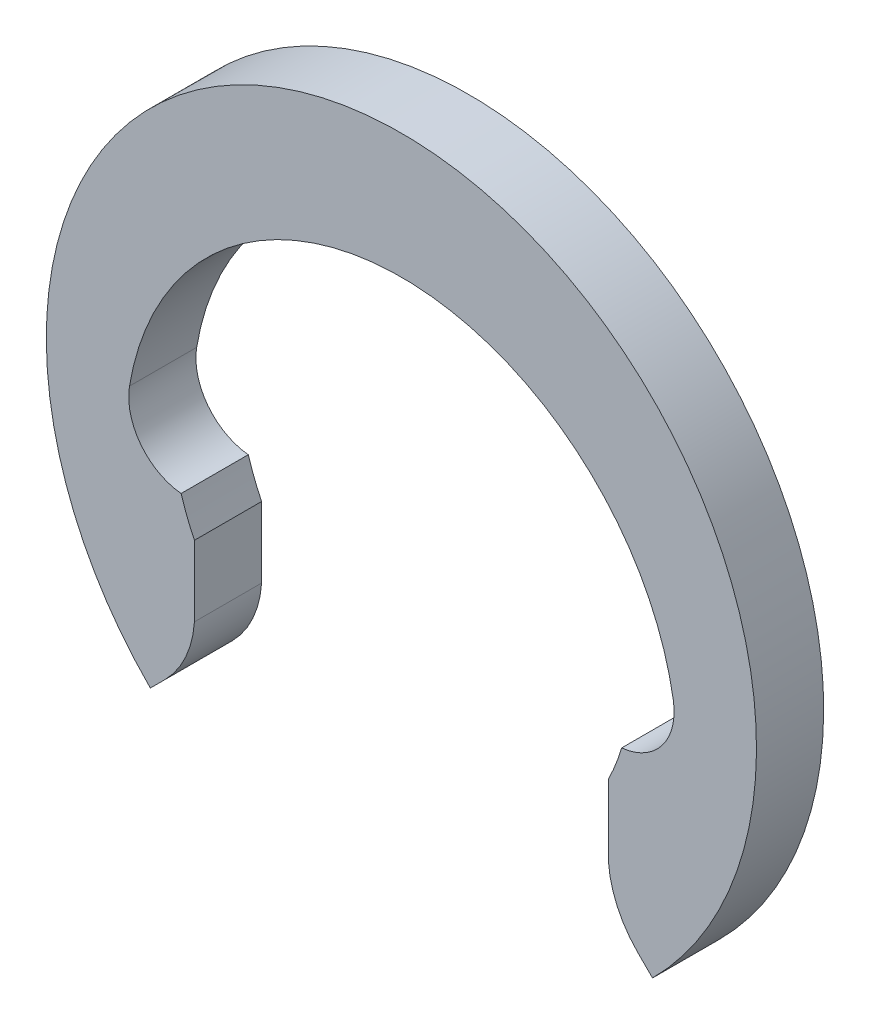
ISO-10303-21;
HEADER;
FILE_DESCRIPTION(('STEP AP214'),'2;1');
FILE_NAME('part.step','',(''),(''),'','','');
FILE_SCHEMA(('AUTOMOTIVE_DESIGN { 1 0 10303 214 1 1 1 1 }'));
ENDSEC;
DATA;
#1=APPLICATION_CONTEXT('core data for automotive mechanical design processes');
#2=APPLICATION_PROTOCOL_DEFINITION('international standard','automotive_design',2000,#1);
#3=PRODUCT_CONTEXT('',#1,'mechanical');
#4=PRODUCT('Part','Part','',(#3));
#5=PRODUCT_RELATED_PRODUCT_CATEGORY('part','',(#4));
#6=PRODUCT_DEFINITION_FORMATION('','',#4);
#7=PRODUCT_DEFINITION_CONTEXT('part definition',#1,'design');
#8=PRODUCT_DEFINITION('design','',#6,#7);
#9=PRODUCT_DEFINITION_SHAPE('','',#8);
#10=(LENGTH_UNIT() NAMED_UNIT(*) SI_UNIT(.MILLI.,.METRE.));
#11=(NAMED_UNIT(*) PLANE_ANGLE_UNIT() SI_UNIT($,.RADIAN.));
#12=(NAMED_UNIT(*) SI_UNIT($,.STERADIAN.) SOLID_ANGLE_UNIT());
#13=UNCERTAINTY_MEASURE_WITH_UNIT(LENGTH_MEASURE(1.E-05),#10,'distance_accuracy_value','');
#14=(GEOMETRIC_REPRESENTATION_CONTEXT(3) GLOBAL_UNCERTAINTY_ASSIGNED_CONTEXT((#13)) GLOBAL_UNIT_ASSIGNED_CONTEXT((#10,
#11,#12)) REPRESENTATION_CONTEXT('',''));
#15=CARTESIAN_POINT('',(0.,0.,0.));
#16=DIRECTION('',(0.,0.,1.));
#17=DIRECTION('',(1.,0.,0.));
#18=AXIS2_PLACEMENT_3D('',#15,#16,#17);
#19=CARTESIAN_POINT('',(-2.23805935440949,-0.0992609633156405,0.7));
#20=DIRECTION('',(0.,0.,-1.));
#21=DIRECTION('',(-1.,0.,0.));
#22=AXIS2_PLACEMENT_3D('',#19,#20,#21);
#23=CYLINDRICAL_SURFACE('',#22,0.603493039580553);
#24=CARTESIAN_POINT('',(-2.23805935440949,-0.0992609633156405,0.));
#25=DIRECTION('',(0.,0.,-1.));
#26=DIRECTION('',(1.,0.,0.));
#27=AXIS2_PLACEMENT_3D('',#24,#25,#26);
#28=CIRCLE('',#27,0.603493039580553);
#29=CARTESIAN_POINT('',(-2.2956480566498,-0.699999999999999,0.));
#30=VERTEX_POINT('',#29);
#31=CARTESIAN_POINT('',(-2.83333333333333,0.,0.));
#32=VERTEX_POINT('',#31);
#33=EDGE_CURVE('E152',#30,#32,#28,.T.);
#34=ORIENTED_EDGE('',*,*,#33,.T.);
#35=DIRECTION('',(0.,0.,-1.));
#36=VECTOR('',#35,1.);
#37=CARTESIAN_POINT('',(-2.83333333333333,0.,0.7));
#38=LINE('',#37,#36);
#39=CARTESIAN_POINT('',(-2.83333333333333,0.,0.7));
#40=VERTEX_POINT('',#39);
#41=EDGE_CURVE('E11',#40,#32,#38,.T.);
#42=ORIENTED_EDGE('',*,*,#41,.F.);
#43=CARTESIAN_POINT('',(-2.23805935440949,-0.0992609633156405,0.7));
#44=DIRECTION('',(0.,0.,-1.));
#45=DIRECTION('',(1.,0.,0.));
#46=AXIS2_PLACEMENT_3D('',#43,#44,#45);
#47=CIRCLE('',#46,0.603493039580553);
#48=CARTESIAN_POINT('',(-2.2956480566498,-0.699999999999999,0.7));
#49=VERTEX_POINT('',#48);
#50=EDGE_CURVE('E175',#49,#40,#47,.T.);
#51=ORIENTED_EDGE('',*,*,#50,.F.);
#52=DIRECTION('',(0.,0.,-1.));
#53=VECTOR('',#52,1.);
#54=CARTESIAN_POINT('',(-2.2956480566498,-0.699999999999999,0.7));
#55=LINE('',#54,#53);
#56=EDGE_CURVE('E148',#49,#30,#55,.T.);
#57=ORIENTED_EDGE('',*,*,#56,.T.);
#58=EDGE_LOOP('',(#34,#42,#51,#57));
#59=FACE_BOUND('',#58,.T.);
#60=ADVANCED_FACE('F32',(#59),#23,.F.);
#61=CARTESIAN_POINT('',(0.,-0.472453703703704,0.7));
#62=DIRECTION('',(0.,0.,-1.));
#63=DIRECTION('',(-1.,0.,0.));
#64=AXIS2_PLACEMENT_3D('',#61,#62,#63);
#65=CYLINDRICAL_SURFACE('',#64,2.8724537037037);
#66=CARTESIAN_POINT('',(0.,-0.472453703703704,0.));
#67=DIRECTION('',(0.,0.,-1.));
#68=DIRECTION('',(1.,0.,0.));
#69=AXIS2_PLACEMENT_3D('',#66,#67,#68);
#70=CIRCLE('',#69,2.8724537037037);
#71=CARTESIAN_POINT('',(2.83333333333333,0.,0.));
#72=VERTEX_POINT('',#71);
#73=EDGE_CURVE('E155',#32,#72,#70,.T.);
#74=ORIENTED_EDGE('',*,*,#73,.T.);
#75=DIRECTION('',(0.,0.,-1.));
#76=VECTOR('',#75,1.);
#77=CARTESIAN_POINT('',(2.83333333333333,0.,0.7));
#78=LINE('',#77,#76);
#79=CARTESIAN_POINT('',(2.83333333333333,0.,0.7));
#80=VERTEX_POINT('',#79);
#81=EDGE_CURVE('E40',#80,#72,#78,.T.);
#82=ORIENTED_EDGE('',*,*,#81,.F.);
#83=CARTESIAN_POINT('',(0.,-0.472453703703704,0.7));
#84=DIRECTION('',(0.,0.,-1.));
#85=DIRECTION('',(1.,0.,0.));
#86=AXIS2_PLACEMENT_3D('',#83,#84,#85);
#87=CIRCLE('',#86,2.8724537037037);
#88=EDGE_CURVE('E102',#40,#80,#87,.T.);
#89=ORIENTED_EDGE('',*,*,#88,.F.);
#90=ORIENTED_EDGE('',*,*,#41,.T.);
#91=EDGE_LOOP('',(#74,#82,#89,#90));
#92=FACE_BOUND('',#91,.T.);
#93=ADVANCED_FACE('F252',(#92),#65,.F.);
#94=CARTESIAN_POINT('',(2.23805935440949,-0.09926096331564,0.7));
#95=DIRECTION('',(0.,0.,-1.));
#96=DIRECTION('',(-1.,0.,0.));
#97=AXIS2_PLACEMENT_3D('',#94,#95,#96);
#98=CYLINDRICAL_SURFACE('',#97,0.603493039580553);
#99=CARTESIAN_POINT('',(2.23805935440949,-0.09926096331564,0.));
#100=DIRECTION('',(0.,0.,-1.));
#101=DIRECTION('',(-1.,0.,0.));
#102=AXIS2_PLACEMENT_3D('',#99,#100,#101);
#103=CIRCLE('',#102,0.603493039580553);
#104=CARTESIAN_POINT('',(2.2956480566498,-0.699999999999999,0.));
#105=VERTEX_POINT('',#104);
#106=EDGE_CURVE('E157',#72,#105,#103,.T.);
#107=ORIENTED_EDGE('',*,*,#106,.T.);
#108=DIRECTION('',(0.,0.,-1.));
#109=VECTOR('',#108,1.);
#110=CARTESIAN_POINT('',(2.2956480566498,-0.699999999999999,0.7));
#111=LINE('',#110,#109);
#112=CARTESIAN_POINT('',(2.2956480566498,-0.699999999999999,0.7));
#113=VERTEX_POINT('',#112);
#114=EDGE_CURVE('E194',#113,#105,#111,.T.);
#115=ORIENTED_EDGE('',*,*,#114,.F.);
#116=CARTESIAN_POINT('',(2.23805935440949,-0.09926096331564,0.7));
#117=DIRECTION('',(0.,0.,-1.));
#118=DIRECTION('',(-1.,0.,0.));
#119=AXIS2_PLACEMENT_3D('',#116,#117,#118);
#120=CIRCLE('',#119,0.603493039580553);
#121=EDGE_CURVE('E202',#80,#113,#120,.T.);
#122=ORIENTED_EDGE('',*,*,#121,.F.);
#123=ORIENTED_EDGE('',*,*,#81,.T.);
#124=EDGE_LOOP('',(#107,#115,#122,#123));
#125=FACE_BOUND('',#124,.T.);
#126=ADVANCED_FACE('F200',(#125),#98,.F.);
#127=CARTESIAN_POINT('',(0.,0.,0.7));
#128=DIRECTION('',(0.,0.,-1.));
#129=DIRECTION('',(-1.,0.,0.));
#130=AXIS2_PLACEMENT_3D('',#127,#128,#129);
#131=CYLINDRICAL_SURFACE('',#130,2.4);
#132=CARTESIAN_POINT('',(0.,0.,0.));
#133=DIRECTION('',(0.,0.,-1.));
#134=DIRECTION('',(-1.,0.,0.));
#135=AXIS2_PLACEMENT_3D('',#132,#133,#134);
#136=CIRCLE('',#135,2.4);
#137=CARTESIAN_POINT('',(2.15667568261897,-1.05297198443263,0.));
#138=VERTEX_POINT('',#137);
#139=EDGE_CURVE('E159',#105,#138,#136,.T.);
#140=ORIENTED_EDGE('',*,*,#139,.T.);
#141=DIRECTION('',(0.,0.,-1.));
#142=VECTOR('',#141,1.);
#143=CARTESIAN_POINT('',(2.15667568261897,-1.05297198443263,0.7));
#144=LINE('',#143,#142);
#145=CARTESIAN_POINT('',(2.15667568261897,-1.05297198443263,0.7));
#146=VERTEX_POINT('',#145);
#147=EDGE_CURVE('E191',#146,#138,#144,.T.);
#148=ORIENTED_EDGE('',*,*,#147,.F.);
#149=CARTESIAN_POINT('',(0.,0.,0.7));
#150=DIRECTION('',(0.,0.,-1.));
#151=DIRECTION('',(-1.,0.,0.));
#152=AXIS2_PLACEMENT_3D('',#149,#150,#151);
#153=CIRCLE('',#152,2.4);
#154=EDGE_CURVE('E219',#113,#146,#153,.T.);
#155=ORIENTED_EDGE('',*,*,#154,.F.);
#156=ORIENTED_EDGE('',*,*,#114,.T.);
#157=EDGE_LOOP('',(#140,#148,#155,#156));
#158=FACE_BOUND('',#157,.T.);
#159=ADVANCED_FACE('F210',(#158),#131,.F.);
#160=CARTESIAN_POINT('',(2.15667568261898,-1.78877444989019,0.7));
#161=DIRECTION('',(1.,0.,0.));
#162=DIRECTION('',(0.,1.,0.));
#163=AXIS2_PLACEMENT_3D('',#160,#161,#162);
#164=PLANE('',#163);
#165=DIRECTION('',(0.,-1.,0.));
#166=VECTOR('',#165,1.);
#167=CARTESIAN_POINT('',(2.15667568261898,-1.78877444989019,0.));
#168=LINE('',#167,#166);
#169=CARTESIAN_POINT('',(2.15667568261898,-1.78877444989019,0.));
#170=VERTEX_POINT('',#169);
#171=EDGE_CURVE('E162',#138,#170,#168,.T.);
#172=ORIENTED_EDGE('',*,*,#171,.T.);
#173=DIRECTION('',(0.,0.,-1.));
#174=VECTOR('',#173,1.);
#175=CARTESIAN_POINT('',(2.15667568261898,-1.78877444989019,0.7));
#176=LINE('',#175,#174);
#177=CARTESIAN_POINT('',(2.15667568261898,-1.78877444989019,0.7));
#178=VERTEX_POINT('',#177);
#179=EDGE_CURVE('E188',#178,#170,#176,.T.);
#180=ORIENTED_EDGE('',*,*,#179,.F.);
#181=DIRECTION('',(0.,-1.,0.));
#182=VECTOR('',#181,1.);
#183=CARTESIAN_POINT('',(2.15667568261897,-1.42087321716141,0.7));
#184=LINE('',#183,#182);
#185=EDGE_CURVE('E216',#146,#178,#184,.T.);
#186=ORIENTED_EDGE('',*,*,#185,.F.);
#187=ORIENTED_EDGE('',*,*,#147,.T.);
#188=EDGE_LOOP('',(#172,#180,#186,#187));
#189=FACE_BOUND('',#188,.T.);
#190=ADVANCED_FACE('F214',(#189),#164,.F.);
#191=CARTESIAN_POINT('',(3.20865351956933,-1.71752372269696,0.7));
#192=DIRECTION('',(0.,0.,-1.));
#193=DIRECTION('',(-1.,0.,0.));
#194=AXIS2_PLACEMENT_3D('',#191,#192,#193);
#195=CYLINDRICAL_SURFACE('',#194,1.05438799099777);
#196=CARTESIAN_POINT('',(3.20865351956933,-1.71752372269696,0.));
#197=DIRECTION('',(0.,0.,1.));
#198=DIRECTION('',(1.,0.,0.));
#199=AXIS2_PLACEMENT_3D('',#196,#197,#198);
#200=CIRCLE('',#199,1.05438799099777);
#201=CARTESIAN_POINT('',(2.46308862113315,-2.46308862113314,0.));
#202=VERTEX_POINT('',#201);
#203=EDGE_CURVE('E164',#170,#202,#200,.T.);
#204=ORIENTED_EDGE('',*,*,#203,.T.);
#205=DIRECTION('',(0.,0.,-1.));
#206=VECTOR('',#205,1.);
#207=CARTESIAN_POINT('',(2.46308862113315,-2.46308862113314,0.7));
#208=LINE('',#207,#206);
#209=CARTESIAN_POINT('',(2.46308862113315,-2.46308862113314,0.7));
#210=VERTEX_POINT('',#209);
#211=EDGE_CURVE('E185',#210,#202,#208,.T.);
#212=ORIENTED_EDGE('',*,*,#211,.F.);
#213=CARTESIAN_POINT('',(3.20865351956933,-1.71752372269696,0.7));
#214=DIRECTION('',(0.,0.,1.));
#215=DIRECTION('',(1.,0.,0.));
#216=AXIS2_PLACEMENT_3D('',#213,#214,#215);
#217=CIRCLE('',#216,1.05438799099777);
#218=EDGE_CURVE('E218',#178,#210,#217,.T.);
#219=ORIENTED_EDGE('',*,*,#218,.F.);
#220=ORIENTED_EDGE('',*,*,#179,.T.);
#221=EDGE_LOOP('',(#204,#212,#219,#220));
#222=FACE_BOUND('',#221,.T.);
#223=ADVANCED_FACE('F265',(#222),#195,.T.);
#224=CARTESIAN_POINT('',(2.46308862113315,-2.46308862113314,0.7));
#225=DIRECTION('',(0.70710678118655,0.707106781186546,0.));
#226=DIRECTION('',(-0.707106781186546,0.70710678118655,0.));
#227=AXIS2_PLACEMENT_3D('',#224,#225,#226);
#228=PLANE('',#227);
#229=DIRECTION('',(0.707106781186546,-0.70710678118655,0.));
#230=VECTOR('',#229,1.);
#231=CARTESIAN_POINT('',(2.46308862113315,-2.46308862113314,0.));
#232=LINE('',#231,#230);
#233=CARTESIAN_POINT('',(2.61629509039023,-2.61629509039022,0.));
#234=VERTEX_POINT('',#233);
#235=EDGE_CURVE('E166',#202,#234,#232,.T.);
#236=ORIENTED_EDGE('',*,*,#235,.T.);
#237=DIRECTION('',(0.,0.,-1.));
#238=VECTOR('',#237,1.);
#239=CARTESIAN_POINT('',(2.61629509039023,-2.61629509039022,0.7));
#240=LINE('',#239,#238);
#241=CARTESIAN_POINT('',(2.61629509039023,-2.61629509039022,0.7));
#242=VERTEX_POINT('',#241);
#243=EDGE_CURVE('E182',#242,#234,#240,.T.);
#244=ORIENTED_EDGE('',*,*,#243,.F.);
#245=DIRECTION('',(0.707106781186546,-0.70710678118655,0.));
#246=VECTOR('',#245,1.);
#247=CARTESIAN_POINT('',(2.46308862113315,-2.46308862113314,0.7));
#248=LINE('',#247,#246);
#249=EDGE_CURVE('E221',#210,#242,#248,.T.);
#250=ORIENTED_EDGE('',*,*,#249,.F.);
#251=ORIENTED_EDGE('',*,*,#211,.T.);
#252=EDGE_LOOP('',(#236,#244,#250,#251));
#253=FACE_BOUND('',#252,.T.);
#254=ADVANCED_FACE('F268',(#253),#228,.F.);
#255=CARTESIAN_POINT('',(0.,0.,0.7));
#256=DIRECTION('',(0.,0.,-1.));
#257=DIRECTION('',(-1.,0.,0.));
#258=AXIS2_PLACEMENT_3D('',#255,#256,#257);
#259=CYLINDRICAL_SURFACE('',#258,3.7);
#260=CARTESIAN_POINT('',(0.,0.,0.));
#261=DIRECTION('',(0.,0.,1.));
#262=DIRECTION('',(1.,0.,0.));
#263=AXIS2_PLACEMENT_3D('',#260,#261,#262);
#264=CIRCLE('',#263,3.7);
#265=CARTESIAN_POINT('',(-2.61629509039023,-2.61629509039022,0.));
#266=VERTEX_POINT('',#265);
#267=EDGE_CURVE('E168',#234,#266,#264,.T.);
#268=ORIENTED_EDGE('',*,*,#267,.T.);
#269=DIRECTION('',(0.,0.,-1.));
#270=VECTOR('',#269,1.);
#271=CARTESIAN_POINT('',(-2.61629509039023,-2.61629509039022,0.7));
#272=LINE('',#271,#270);
#273=CARTESIAN_POINT('',(-2.61629509039023,-2.61629509039022,0.7));
#274=VERTEX_POINT('',#273);
#275=EDGE_CURVE('E179',#274,#266,#272,.T.);
#276=ORIENTED_EDGE('',*,*,#275,.F.);
#277=CARTESIAN_POINT('',(0.,0.,0.7));
#278=DIRECTION('',(0.,0.,1.));
#279=DIRECTION('',(1.,0.,0.));
#280=AXIS2_PLACEMENT_3D('',#277,#278,#279);
#281=CIRCLE('',#280,3.7);
#282=EDGE_CURVE('E227',#242,#274,#281,.T.);
#283=ORIENTED_EDGE('',*,*,#282,.F.);
#284=ORIENTED_EDGE('',*,*,#243,.T.);
#285=EDGE_LOOP('',(#268,#276,#283,#284));
#286=FACE_BOUND('',#285,.T.);
#287=ADVANCED_FACE('F233',(#286),#259,.T.);
#288=CARTESIAN_POINT('',(-2.46308862113314,-2.46308862113314,0.7));
#289=DIRECTION('',(-0.70710678118655,0.707106781186546,0.));
#290=DIRECTION('',(-0.707106781186546,-0.70710678118655,0.));
#291=AXIS2_PLACEMENT_3D('',#288,#289,#290);
#292=PLANE('',#291);
#293=DIRECTION('',(0.707106781186546,0.70710678118655,0.));
#294=VECTOR('',#293,1.);
#295=CARTESIAN_POINT('',(-2.46308862113314,-2.46308862113314,0.));
#296=LINE('',#295,#294);
#297=CARTESIAN_POINT('',(-2.46308862113314,-2.46308862113314,0.));
#298=VERTEX_POINT('',#297);
#299=EDGE_CURVE('E170',#266,#298,#296,.T.);
#300=ORIENTED_EDGE('',*,*,#299,.T.);
#301=DIRECTION('',(0.,0.,-1.));
#302=VECTOR('',#301,1.);
#303=CARTESIAN_POINT('',(-2.46308862113314,-2.46308862113314,0.7));
#304=LINE('',#303,#302);
#305=CARTESIAN_POINT('',(-2.46308862113314,-2.46308862113314,0.7));
#306=VERTEX_POINT('',#305);
#307=EDGE_CURVE('E143',#306,#298,#304,.T.);
#308=ORIENTED_EDGE('',*,*,#307,.F.);
#309=DIRECTION('',(0.707106781186546,0.70710678118655,0.));
#310=VECTOR('',#309,1.);
#311=CARTESIAN_POINT('',(-2.46308862113314,-2.46308862113314,0.7));
#312=LINE('',#311,#310);
#313=EDGE_CURVE('E133',#274,#306,#312,.T.);
#314=ORIENTED_EDGE('',*,*,#313,.F.);
#315=ORIENTED_EDGE('',*,*,#275,.T.);
#316=EDGE_LOOP('',(#300,#308,#314,#315));
#317=FACE_BOUND('',#316,.T.);
#318=ADVANCED_FACE('F237',(#317),#292,.F.);
#319=CARTESIAN_POINT('',(-3.20865351956933,-1.71752372269696,0.7));
#320=DIRECTION('',(0.,0.,-1.));
#321=DIRECTION('',(-1.,0.,0.));
#322=AXIS2_PLACEMENT_3D('',#319,#320,#321);
#323=CYLINDRICAL_SURFACE('',#322,1.05438799099777);
#324=CARTESIAN_POINT('',(-3.20865351956933,-1.71752372269696,0.));
#325=DIRECTION('',(0.,0.,1.));
#326=DIRECTION('',(-1.,0.,0.));
#327=AXIS2_PLACEMENT_3D('',#324,#325,#326);
#328=CIRCLE('',#327,1.05438799099777);
#329=CARTESIAN_POINT('',(-2.15667568261897,-1.78877444989019,0.));
#330=VERTEX_POINT('',#329);
#331=EDGE_CURVE('E142',#298,#330,#328,.T.);
#332=ORIENTED_EDGE('',*,*,#331,.T.);
#333=DIRECTION('',(0.,0.,-1.));
#334=VECTOR('',#333,1.);
#335=CARTESIAN_POINT('',(-2.15667568261897,-1.78877444989019,0.7));
#336=LINE('',#335,#334);
#337=CARTESIAN_POINT('',(-2.15667568261897,-1.78877444989019,0.7));
#338=VERTEX_POINT('',#337);
#339=EDGE_CURVE('E139',#338,#330,#336,.T.);
#340=ORIENTED_EDGE('',*,*,#339,.F.);
#341=CARTESIAN_POINT('',(-3.20865351956933,-1.71752372269696,0.7));
#342=DIRECTION('',(0.,0.,1.));
#343=DIRECTION('',(-1.,0.,0.));
#344=AXIS2_PLACEMENT_3D('',#341,#342,#343);
#345=CIRCLE('',#344,1.05438799099777);
#346=EDGE_CURVE('E127',#306,#338,#345,.T.);
#347=ORIENTED_EDGE('',*,*,#346,.F.);
#348=ORIENTED_EDGE('',*,*,#307,.T.);
#349=EDGE_LOOP('',(#332,#340,#347,#348));
#350=FACE_BOUND('',#349,.T.);
#351=ADVANCED_FACE('F140',(#350),#323,.T.);
#352=CARTESIAN_POINT('',(-2.15667568261897,-1.42087321716141,0.7));
#353=DIRECTION('',(-1.,0.,0.));
#354=DIRECTION('',(0.,0.,1.));
#355=AXIS2_PLACEMENT_3D('',#352,#353,#354);
#356=PLANE('',#355);
#357=DIRECTION('',(0.,1.,0.));
#358=VECTOR('',#357,1.);
#359=CARTESIAN_POINT('',(-2.15667568261897,-1.42087321716141,0.));
#360=LINE('',#359,#358);
#361=CARTESIAN_POINT('',(-2.15667568261897,-1.05297198443263,0.));
#362=VERTEX_POINT('',#361);
#363=EDGE_CURVE('E88',#330,#362,#360,.T.);
#364=ORIENTED_EDGE('',*,*,#363,.T.);
#365=DIRECTION('',(0.,0.,-1.));
#366=VECTOR('',#365,1.);
#367=CARTESIAN_POINT('',(-2.15667568261897,-1.05297198443263,0.7));
#368=LINE('',#367,#366);
#369=CARTESIAN_POINT('',(-2.15667568261897,-1.05297198443263,0.7));
#370=VERTEX_POINT('',#369);
#371=EDGE_CURVE('E144',#370,#362,#368,.T.);
#372=ORIENTED_EDGE('',*,*,#371,.F.);
#373=DIRECTION('',(0.,1.,0.));
#374=VECTOR('',#373,1.);
#375=CARTESIAN_POINT('',(-2.15667568261897,-1.78877444989019,0.7));
#376=LINE('',#375,#374);
#377=EDGE_CURVE('E131',#338,#370,#376,.T.);
#378=ORIENTED_EDGE('',*,*,#377,.F.);
#379=ORIENTED_EDGE('',*,*,#339,.T.);
#380=EDGE_LOOP('',(#364,#372,#378,#379));
#381=FACE_BOUND('',#380,.T.);
#382=ADVANCED_FACE('F146',(#381),#356,.F.);
#383=CARTESIAN_POINT('',(0.,0.,0.7));
#384=DIRECTION('',(0.,0.,-1.));
#385=DIRECTION('',(-1.,0.,0.));
#386=AXIS2_PLACEMENT_3D('',#383,#384,#385);
#387=CYLINDRICAL_SURFACE('',#386,2.4);
#388=CARTESIAN_POINT('',(0.,0.,0.));
#389=DIRECTION('',(0.,0.,-1.));
#390=DIRECTION('',(1.,0.,0.));
#391=AXIS2_PLACEMENT_3D('',#388,#389,#390);
#392=CIRCLE('',#391,2.4);
#393=EDGE_CURVE('E94',#362,#30,#392,.T.);
#394=ORIENTED_EDGE('',*,*,#393,.T.);
#395=ORIENTED_EDGE('',*,*,#56,.F.);
#396=CARTESIAN_POINT('',(0.,0.,0.7));
#397=DIRECTION('',(0.,0.,-1.));
#398=DIRECTION('',(1.,0.,0.));
#399=AXIS2_PLACEMENT_3D('',#396,#397,#398);
#400=CIRCLE('',#399,2.4);
#401=EDGE_CURVE('E48',#370,#49,#400,.T.);
#402=ORIENTED_EDGE('',*,*,#401,.F.);
#403=ORIENTED_EDGE('',*,*,#371,.T.);
#404=EDGE_LOOP('',(#394,#395,#402,#403));
#405=FACE_BOUND('',#404,.T.);
#406=ADVANCED_FACE('F241',(#405),#387,.F.);
#407=CARTESIAN_POINT('',(-2.23805935440949,-0.0992609633156405,0.7));
#408=DIRECTION('',(0.,0.,1.));
#409=DIRECTION('',(1.,0.,0.));
#410=AXIS2_PLACEMENT_3D('',#407,#408,#409);
#411=PLANE('',#410);
#412=ORIENTED_EDGE('',*,*,#50,.T.);
#413=ORIENTED_EDGE('',*,*,#88,.T.);
#414=ORIENTED_EDGE('',*,*,#121,.T.);
#415=ORIENTED_EDGE('',*,*,#154,.T.);
#416=ORIENTED_EDGE('',*,*,#185,.T.);
#417=ORIENTED_EDGE('',*,*,#218,.T.);
#418=ORIENTED_EDGE('',*,*,#249,.T.);
#419=ORIENTED_EDGE('',*,*,#282,.T.);
#420=ORIENTED_EDGE('',*,*,#313,.T.);
#421=ORIENTED_EDGE('',*,*,#346,.T.);
#422=ORIENTED_EDGE('',*,*,#377,.T.);
#423=ORIENTED_EDGE('',*,*,#401,.T.);
#424=EDGE_LOOP('',(#412,#413,#414,#415,#416,#417,#418,#419,#420,#421,#422,#423));
#425=FACE_BOUND('',#424,.T.);
#426=ADVANCED_FACE('F129',(#425),#411,.T.);
#427=CARTESIAN_POINT('',(-2.23805935440949,-0.0992609633156405,0.));
#428=DIRECTION('',(0.,0.,1.));
#429=DIRECTION('',(1.,0.,0.));
#430=AXIS2_PLACEMENT_3D('',#427,#428,#429);
#431=PLANE('',#430);
#432=ORIENTED_EDGE('',*,*,#33,.F.);
#433=ORIENTED_EDGE('',*,*,#393,.F.);
#434=ORIENTED_EDGE('',*,*,#363,.F.);
#435=ORIENTED_EDGE('',*,*,#331,.F.);
#436=ORIENTED_EDGE('',*,*,#299,.F.);
#437=ORIENTED_EDGE('',*,*,#267,.F.);
#438=ORIENTED_EDGE('',*,*,#235,.F.);
#439=ORIENTED_EDGE('',*,*,#203,.F.);
#440=ORIENTED_EDGE('',*,*,#171,.F.);
#441=ORIENTED_EDGE('',*,*,#139,.F.);
#442=ORIENTED_EDGE('',*,*,#106,.F.);
#443=ORIENTED_EDGE('',*,*,#73,.F.);
#444=EDGE_LOOP('',(#432,#433,#434,#435,#436,#437,#438,#439,#440,#441,#442,#443));
#445=FACE_BOUND('',#444,.T.);
#446=ADVANCED_FACE('F206',(#445),#431,.F.);
#447=CLOSED_SHELL('',(#60,#93,#126,#159,#190,#223,#254,#287,#318,#351,#382,#406,#426,#446));
#448=MANIFOLD_SOLID_BREP('B2',#447);
#449=ADVANCED_BREP_SHAPE_REPRESENTATION('',(#18,#448),#14);
#450=SHAPE_DEFINITION_REPRESENTATION(#9,#449);
ENDSEC;
END-ISO-10303-21;
